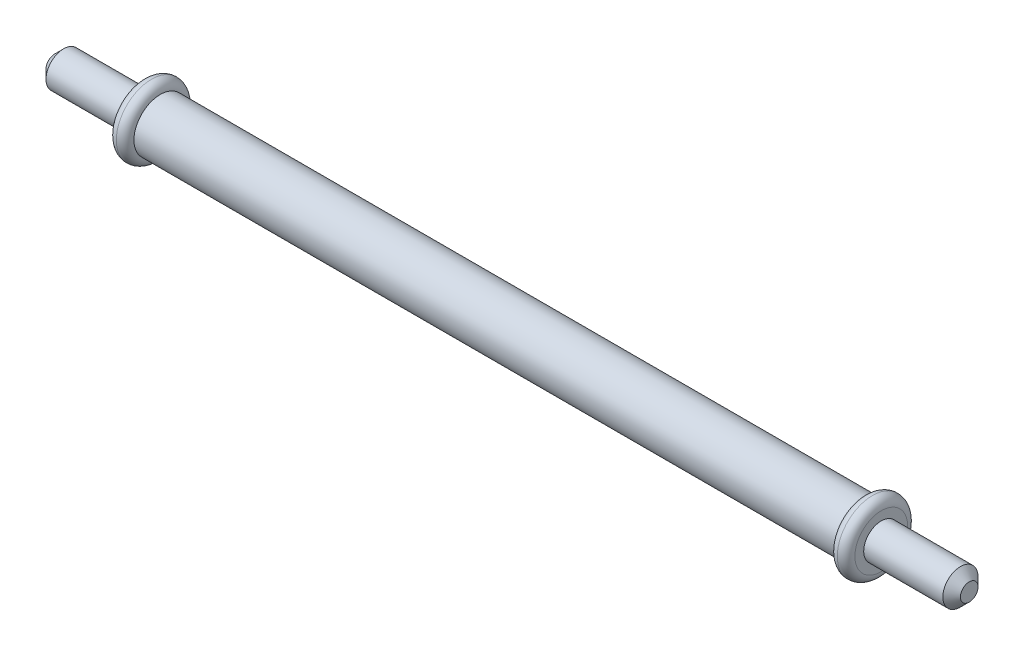
ISO-10303-21;
HEADER;
FILE_DESCRIPTION(('STEP AP214'),'2;1');
FILE_NAME('part.step','',(''),(''),'','','');
FILE_SCHEMA(('AUTOMOTIVE_DESIGN { 1 0 10303 214 1 1 1 1 }'));
ENDSEC;
DATA;
#1=APPLICATION_CONTEXT('core data for automotive mechanical design processes');
#2=APPLICATION_PROTOCOL_DEFINITION('international standard','automotive_design',2000,#1);
#3=PRODUCT_CONTEXT('',#1,'mechanical');
#4=PRODUCT('Part','Part','',(#3));
#5=PRODUCT_RELATED_PRODUCT_CATEGORY('part','',(#4));
#6=PRODUCT_DEFINITION_FORMATION('','',#4);
#7=PRODUCT_DEFINITION_CONTEXT('part definition',#1,'design');
#8=PRODUCT_DEFINITION('design','',#6,#7);
#9=PRODUCT_DEFINITION_SHAPE('','',#8);
#10=(LENGTH_UNIT() NAMED_UNIT(*) SI_UNIT(.MILLI.,.METRE.));
#11=(NAMED_UNIT(*) PLANE_ANGLE_UNIT() SI_UNIT($,.RADIAN.));
#12=(NAMED_UNIT(*) SI_UNIT($,.STERADIAN.) SOLID_ANGLE_UNIT());
#13=UNCERTAINTY_MEASURE_WITH_UNIT(LENGTH_MEASURE(1.E-05),#10,'distance_accuracy_value','');
#14=(GEOMETRIC_REPRESENTATION_CONTEXT(3) GLOBAL_UNCERTAINTY_ASSIGNED_CONTEXT((#13)) GLOBAL_UNIT_ASSIGNED_CONTEXT((#10,
#11,#12)) REPRESENTATION_CONTEXT('',''));
#15=CARTESIAN_POINT('',(0.,0.,0.));
#16=DIRECTION('',(0.,0.,1.));
#17=DIRECTION('',(1.,0.,0.));
#18=AXIS2_PLACEMENT_3D('',#15,#16,#17);
#19=CARTESIAN_POINT('',(0.,0.,0.));
#20=DIRECTION('',(-1.,0.,0.));
#21=DIRECTION('',(0.,0.,1.));
#22=AXIS2_PLACEMENT_3D('',#19,#20,#21);
#23=CYLINDRICAL_SURFACE('',#22,3.);
#24=CARTESIAN_POINT('',(92.,0.,0.));
#25=DIRECTION('',(1.,0.,0.));
#26=DIRECTION('',(0.,0.,-1.));
#27=AXIS2_PLACEMENT_3D('',#24,#25,#26);
#28=CIRCLE('',#27,3.);
#29=CARTESIAN_POINT('',(92.,0.,-3.));
#30=VERTEX_POINT('',#29);
#31=EDGE_CURVE('E77',#30,#30,#28,.F.);
#32=ORIENTED_EDGE('',*,*,#31,.T.);
#33=EDGE_LOOP('',(#32));
#34=FACE_BOUND('',#33,.T.);
#35=CARTESIAN_POINT('',(12.,0.,0.));
#36=DIRECTION('',(-1.,0.,0.));
#37=DIRECTION('',(0.,0.,1.));
#38=AXIS2_PLACEMENT_3D('',#35,#36,#37);
#39=CIRCLE('',#38,3.);
#40=CARTESIAN_POINT('',(12.,0.,3.));
#41=VERTEX_POINT('',#40);
#42=EDGE_CURVE('E57',#41,#41,#39,.F.);
#43=ORIENTED_EDGE('',*,*,#42,.T.);
#44=EDGE_LOOP('',(#43));
#45=FACE_BOUND('',#44,.T.);
#46=ADVANCED_FACE('F40',(#34,#45),#23,.T.);
#47=CARTESIAN_POINT('',(104.,0.,0.));
#48=DIRECTION('',(-1.,0.,0.));
#49=DIRECTION('',(0.,0.,1.));
#50=AXIS2_PLACEMENT_3D('',#47,#48,#49);
#51=PLANE('',#50);
#52=CARTESIAN_POINT('',(104.,0.,0.));
#53=DIRECTION('',(-1.,0.,0.));
#54=DIRECTION('',(0.,0.,1.));
#55=AXIS2_PLACEMENT_3D('',#52,#53,#54);
#56=CIRCLE('',#55,1.00000000000001);
#57=CARTESIAN_POINT('',(104.,0.,1.00000000000001));
#58=VERTEX_POINT('',#57);
#59=EDGE_CURVE('E65',#58,#58,#56,.F.);
#60=ORIENTED_EDGE('',*,*,#59,.T.);
#61=EDGE_LOOP('',(#60));
#62=FACE_BOUND('',#61,.T.);
#63=ADVANCED_FACE('F109',(#62),#51,.F.);
#64=CARTESIAN_POINT('',(0.,0.,0.));
#65=DIRECTION('',(-1.,0.,0.));
#66=DIRECTION('',(0.,0.,1.));
#67=AXIS2_PLACEMENT_3D('',#64,#65,#66);
#68=CYLINDRICAL_SURFACE('',#67,2.);
#69=CARTESIAN_POINT('',(103.,0.,0.));
#70=DIRECTION('',(-1.,0.,0.));
#71=DIRECTION('',(0.,0.,1.));
#72=AXIS2_PLACEMENT_3D('',#69,#70,#71);
#73=CIRCLE('',#72,2.);
#74=CARTESIAN_POINT('',(103.,0.,2.));
#75=VERTEX_POINT('',#74);
#76=EDGE_CURVE('E69',#75,#75,#73,.T.);
#77=ORIENTED_EDGE('',*,*,#76,.T.);
#78=EDGE_LOOP('',(#77));
#79=FACE_BOUND('',#78,.T.);
#80=CARTESIAN_POINT('',(94.,0.,0.));
#81=DIRECTION('',(-1.,0.,0.));
#82=DIRECTION('',(0.,0.,1.));
#83=AXIS2_PLACEMENT_3D('',#80,#81,#82);
#84=CIRCLE('',#83,2.);
#85=CARTESIAN_POINT('',(94.,0.,2.));
#86=VERTEX_POINT('',#85);
#87=EDGE_CURVE('E81',#86,#86,#84,.T.);
#88=ORIENTED_EDGE('',*,*,#87,.F.);
#89=EDGE_LOOP('',(#88));
#90=FACE_BOUND('',#89,.T.);
#91=ADVANCED_FACE('F114',(#79,#90),#68,.T.);
#92=CARTESIAN_POINT('',(94.,0.,0.));
#93=DIRECTION('',(-1.,0.,0.));
#94=DIRECTION('',(0.,0.,1.));
#95=AXIS2_PLACEMENT_3D('',#92,#93,#94);
#96=PLANE('',#95);
#97=CARTESIAN_POINT('',(94.,0.,0.));
#98=DIRECTION('',(-1.,0.,0.));
#99=DIRECTION('',(0.,0.,1.));
#100=AXIS2_PLACEMENT_3D('',#97,#98,#99);
#101=CIRCLE('',#100,3.);
#102=CARTESIAN_POINT('',(94.,0.,3.));
#103=VERTEX_POINT('',#102);
#104=EDGE_CURVE('E73',#103,#103,#101,.F.);
#105=ORIENTED_EDGE('',*,*,#104,.T.);
#106=EDGE_LOOP('',(#105));
#107=FACE_BOUND('',#106,.T.);
#108=ORIENTED_EDGE('',*,*,#87,.T.);
#109=EDGE_LOOP('',(#108));
#110=FACE_BOUND('',#109,.T.);
#111=ADVANCED_FACE('F119',(#107,#110),#96,.F.);
#112=CARTESIAN_POINT('',(93.,0.,0.));
#113=DIRECTION('',(1.,0.,0.));
#114=DIRECTION('',(0.,0.,-1.));
#115=AXIS2_PLACEMENT_3D('',#112,#113,#114);
#116=TOROIDAL_SURFACE('',#115,3.,1.);
#117=ORIENTED_EDGE('',*,*,#31,.F.);
#118=EDGE_LOOP('',(#117));
#119=FACE_BOUND('',#118,.T.);
#120=CARTESIAN_POINT('',(93.,0.,0.));
#121=DIRECTION('',(1.,0.,0.));
#122=DIRECTION('',(0.,0.,-1.));
#123=AXIS2_PLACEMENT_3D('',#120,#121,#122);
#124=CIRCLE('',#123,4.);
#125=CARTESIAN_POINT('',(93.,0.,-4.));
#126=VERTEX_POINT('',#125);
#127=EDGE_CURVE('E60',#126,#126,#124,.T.);
#128=ORIENTED_EDGE('',*,*,#127,.F.);
#129=EDGE_LOOP('',(#128));
#130=FACE_BOUND('',#129,.T.);
#131=ADVANCED_FACE('F122',(#119,#130),#116,.T.);
#132=CARTESIAN_POINT('',(93.,0.,0.));
#133=DIRECTION('',(-1.,0.,0.));
#134=DIRECTION('',(0.,0.,1.));
#135=AXIS2_PLACEMENT_3D('',#132,#133,#134);
#136=TOROIDAL_SURFACE('',#135,3.,1.);
#137=ORIENTED_EDGE('',*,*,#127,.T.);
#138=EDGE_LOOP('',(#137));
#139=FACE_BOUND('',#138,.T.);
#140=ORIENTED_EDGE('',*,*,#104,.F.);
#141=EDGE_LOOP('',(#140));
#142=FACE_BOUND('',#141,.T.);
#143=ADVANCED_FACE('F127',(#139,#142),#136,.T.);
#144=CARTESIAN_POINT('',(103.,0.,0.));
#145=DIRECTION('',(-1.,0.,0.));
#146=DIRECTION('',(0.,0.,1.));
#147=AXIS2_PLACEMENT_3D('',#144,#145,#146);
#148=CONICAL_SURFACE('',#147,2.,0.785398163397447);
#149=ORIENTED_EDGE('',*,*,#59,.F.);
#150=EDGE_LOOP('',(#149));
#151=FACE_BOUND('',#150,.T.);
#152=ORIENTED_EDGE('',*,*,#76,.F.);
#153=EDGE_LOOP('',(#152));
#154=FACE_BOUND('',#153,.T.);
#155=ADVANCED_FACE('F130',(#151,#154),#148,.T.);
#156=CARTESIAN_POINT('',(0.,0.,0.));
#157=DIRECTION('',(-1.,0.,0.));
#158=DIRECTION('',(0.,0.,1.));
#159=AXIS2_PLACEMENT_3D('',#156,#157,#158);
#160=PLANE('',#159);
#161=CARTESIAN_POINT('',(0.,0.,0.));
#162=DIRECTION('',(-1.,0.,0.));
#163=DIRECTION('',(0.,0.,1.));
#164=AXIS2_PLACEMENT_3D('',#161,#162,#163);
#165=CIRCLE('',#164,0.999999999999973);
#166=CARTESIAN_POINT('',(0.,0.,0.999999999999973));
#167=VERTEX_POINT('',#166);
#168=EDGE_CURVE('E54',#167,#167,#165,.T.);
#169=ORIENTED_EDGE('',*,*,#168,.T.);
#170=EDGE_LOOP('',(#169));
#171=FACE_BOUND('',#170,.T.);
#172=ADVANCED_FACE('F141',(#171),#160,.T.);
#173=CARTESIAN_POINT('',(0.,0.,0.));
#174=DIRECTION('',(1.,0.,0.));
#175=DIRECTION('',(0.,0.,-1.));
#176=AXIS2_PLACEMENT_3D('',#173,#174,#175);
#177=CONICAL_SURFACE('',#176,0.999999999999973,0.785398163397452);
#178=CARTESIAN_POINT('',(1.00000000000002,0.,0.));
#179=DIRECTION('',(-1.,0.,0.));
#180=DIRECTION('',(0.,0.,1.));
#181=AXIS2_PLACEMENT_3D('',#178,#179,#180);
#182=CIRCLE('',#181,2.);
#183=CARTESIAN_POINT('',(1.00000000000002,0.,2.));
#184=VERTEX_POINT('',#183);
#185=EDGE_CURVE('E49',#184,#184,#182,.F.);
#186=ORIENTED_EDGE('',*,*,#185,.F.);
#187=EDGE_LOOP('',(#186));
#188=FACE_BOUND('',#187,.T.);
#189=ORIENTED_EDGE('',*,*,#168,.F.);
#190=EDGE_LOOP('',(#189));
#191=FACE_BOUND('',#190,.T.);
#192=ADVANCED_FACE('F104',(#188,#191),#177,.T.);
#193=CARTESIAN_POINT('',(0.,0.,0.));
#194=DIRECTION('',(-1.,0.,0.));
#195=DIRECTION('',(0.,0.,1.));
#196=AXIS2_PLACEMENT_3D('',#193,#194,#195);
#197=CYLINDRICAL_SURFACE('',#196,2.);
#198=ORIENTED_EDGE('',*,*,#185,.T.);
#199=EDGE_LOOP('',(#198));
#200=FACE_BOUND('',#199,.T.);
#201=CARTESIAN_POINT('',(10.,0.,0.));
#202=DIRECTION('',(-1.,0.,0.));
#203=DIRECTION('',(0.,0.,1.));
#204=AXIS2_PLACEMENT_3D('',#201,#202,#203);
#205=CIRCLE('',#204,2.);
#206=CARTESIAN_POINT('',(10.,0.,2.));
#207=VERTEX_POINT('',#206);
#208=EDGE_CURVE('E85',#207,#207,#205,.T.);
#209=ORIENTED_EDGE('',*,*,#208,.T.);
#210=EDGE_LOOP('',(#209));
#211=FACE_BOUND('',#210,.T.);
#212=ADVANCED_FACE('F93',(#200,#211),#197,.T.);
#213=CARTESIAN_POINT('',(10.,0.,0.));
#214=DIRECTION('',(-1.,0.,0.));
#215=DIRECTION('',(0.,0.,1.));
#216=AXIS2_PLACEMENT_3D('',#213,#214,#215);
#217=PLANE('',#216);
#218=CARTESIAN_POINT('',(10.,0.,0.));
#219=DIRECTION('',(-1.,0.,0.));
#220=DIRECTION('',(0.,0.,1.));
#221=AXIS2_PLACEMENT_3D('',#218,#219,#220);
#222=CIRCLE('',#221,3.);
#223=CARTESIAN_POINT('',(10.,0.,3.));
#224=VERTEX_POINT('',#223);
#225=EDGE_CURVE('E10',#224,#224,#222,.T.);
#226=ORIENTED_EDGE('',*,*,#225,.T.);
#227=EDGE_LOOP('',(#226));
#228=FACE_BOUND('',#227,.T.);
#229=ORIENTED_EDGE('',*,*,#208,.F.);
#230=EDGE_LOOP('',(#229));
#231=FACE_BOUND('',#230,.T.);
#232=ADVANCED_FACE('F95',(#228,#231),#217,.T.);
#233=CARTESIAN_POINT('',(11.,0.,0.));
#234=DIRECTION('',(-1.,0.,0.));
#235=DIRECTION('',(0.,0.,1.));
#236=AXIS2_PLACEMENT_3D('',#233,#234,#235);
#237=TOROIDAL_SURFACE('',#236,3.,1.);
#238=ORIENTED_EDGE('',*,*,#42,.F.);
#239=EDGE_LOOP('',(#238));
#240=FACE_BOUND('',#239,.T.);
#241=CARTESIAN_POINT('',(11.,0.,0.));
#242=DIRECTION('',(-1.,0.,0.));
#243=DIRECTION('',(0.,0.,1.));
#244=AXIS2_PLACEMENT_3D('',#241,#242,#243);
#245=CIRCLE('',#244,4.);
#246=CARTESIAN_POINT('',(11.,0.,4.));
#247=VERTEX_POINT('',#246);
#248=EDGE_CURVE('E44',#247,#247,#245,.T.);
#249=ORIENTED_EDGE('',*,*,#248,.F.);
#250=EDGE_LOOP('',(#249));
#251=FACE_BOUND('',#250,.T.);
#252=ADVANCED_FACE('F42',(#240,#251),#237,.T.);
#253=CARTESIAN_POINT('',(11.,0.,0.));
#254=DIRECTION('',(-1.,0.,0.));
#255=DIRECTION('',(0.,0.,1.));
#256=AXIS2_PLACEMENT_3D('',#253,#254,#255);
#257=TOROIDAL_SURFACE('',#256,3.,1.);
#258=ORIENTED_EDGE('',*,*,#248,.T.);
#259=EDGE_LOOP('',(#258));
#260=FACE_BOUND('',#259,.T.);
#261=ORIENTED_EDGE('',*,*,#225,.F.);
#262=EDGE_LOOP('',(#261));
#263=FACE_BOUND('',#262,.T.);
#264=ADVANCED_FACE('F102',(#260,#263),#257,.T.);
#265=CLOSED_SHELL('',(#46,#63,#91,#111,#131,#143,#155,#172,#192,#212,#232,#252,#264));
#266=MANIFOLD_SOLID_BREP('B2',#265);
#267=ADVANCED_BREP_SHAPE_REPRESENTATION('',(#18,#266),#14);
#268=SHAPE_DEFINITION_REPRESENTATION(#9,#267);
ENDSEC;
END-ISO-10303-21;
